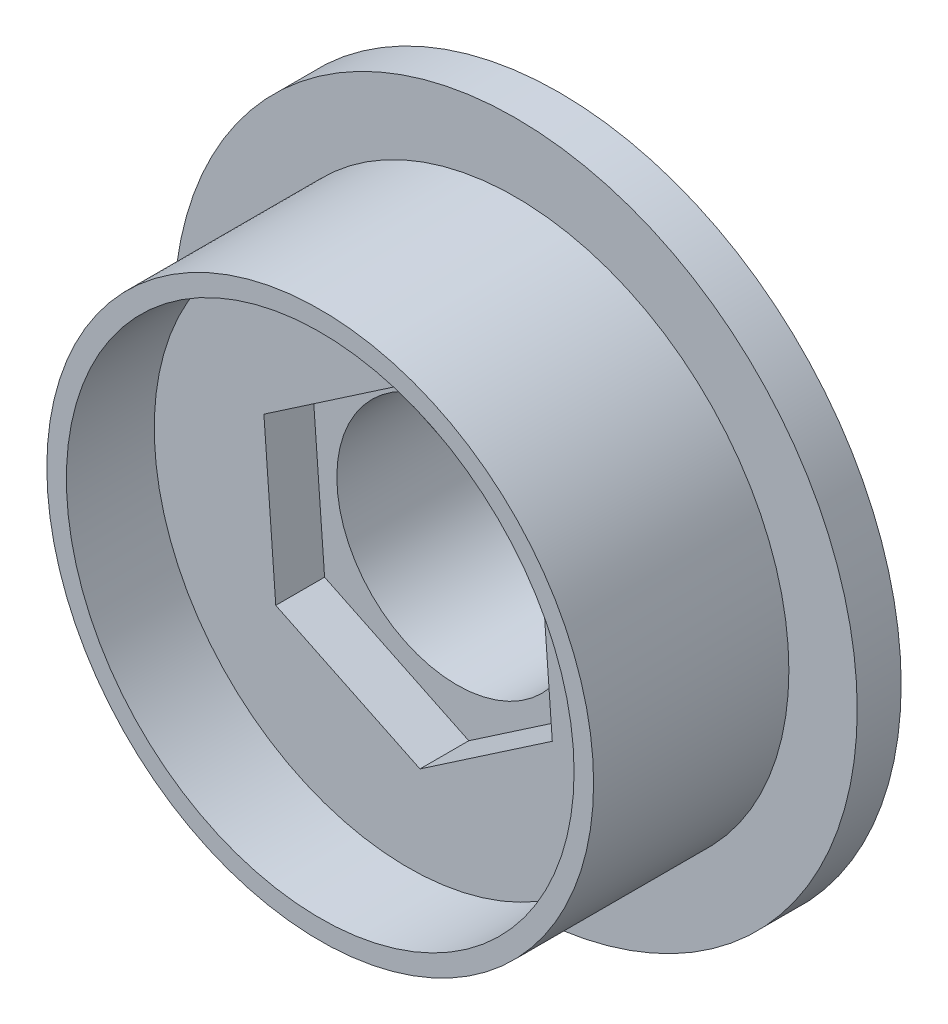
ISO-10303-21;
HEADER;
FILE_DESCRIPTION(('STEP AP214'),'2;1');
FILE_NAME('part.step','',(''),(''),'','','');
FILE_SCHEMA(('AUTOMOTIVE_DESIGN { 1 0 10303 214 1 1 1 1 }'));
ENDSEC;
DATA;
#1=APPLICATION_CONTEXT('core data for automotive mechanical design processes');
#2=APPLICATION_PROTOCOL_DEFINITION('international standard','automotive_design',2000,#1);
#3=PRODUCT_CONTEXT('',#1,'mechanical');
#4=PRODUCT('Part','Part','',(#3));
#5=PRODUCT_RELATED_PRODUCT_CATEGORY('part','',(#4));
#6=PRODUCT_DEFINITION_FORMATION('','',#4);
#7=PRODUCT_DEFINITION_CONTEXT('part definition',#1,'design');
#8=PRODUCT_DEFINITION('design','',#6,#7);
#9=PRODUCT_DEFINITION_SHAPE('','',#8);
#10=(LENGTH_UNIT() NAMED_UNIT(*) SI_UNIT(.MILLI.,.METRE.));
#11=(NAMED_UNIT(*) PLANE_ANGLE_UNIT() SI_UNIT($,.RADIAN.));
#12=(NAMED_UNIT(*) SI_UNIT($,.STERADIAN.) SOLID_ANGLE_UNIT());
#13=UNCERTAINTY_MEASURE_WITH_UNIT(LENGTH_MEASURE(1.E-05),#10,'distance_accuracy_value','');
#14=(GEOMETRIC_REPRESENTATION_CONTEXT(3) GLOBAL_UNCERTAINTY_ASSIGNED_CONTEXT((#13)) GLOBAL_UNIT_ASSIGNED_CONTEXT((#10,
#11,#12)) REPRESENTATION_CONTEXT('',''));
#15=CARTESIAN_POINT('',(0.,0.,0.));
#16=DIRECTION('',(0.,0.,1.));
#17=DIRECTION('',(1.,0.,0.));
#18=AXIS2_PLACEMENT_3D('',#15,#16,#17);
#19=CARTESIAN_POINT('',(-6.77616730245649,-4.75600427750777,-22.0341870366983));
#20=DIRECTION('',(-0.434342885523803,-0.900747610485233,0.));
#21=DIRECTION('',(0.900747610485233,-0.434342885523803,0.));
#22=AXIS2_PLACEMENT_3D('',#19,#20,#21);
#23=PLANE('',#22);
#24=DIRECTION('',(-0.900747610485233,0.434342885523803,0.));
#25=VECTOR('',#24,1.);
#26=CARTESIAN_POINT('',(-6.77616730245648,-4.75600427750777,9.75));
#27=LINE('',#26,#25);
#28=CARTESIAN_POINT('',(0.60849832801848,-8.31690962017206,9.75));
#29=VERTEX_POINT('',#28);
#30=CARTESIAN_POINT('',(-6.77616730245649,-4.75600427750777,9.75));
#31=VERTEX_POINT('',#30);
#32=EDGE_CURVE('E99',#29,#31,#27,.T.);
#33=ORIENTED_EDGE('',*,*,#32,.F.);
#34=DIRECTION('',(0.,0.,1.));
#35=VECTOR('',#34,1.);
#36=CARTESIAN_POINT('',(0.60849832801848,-8.31690962017206,-22.0341870366983));
#37=LINE('',#36,#35);
#38=CARTESIAN_POINT('',(0.60849832801848,-8.31690962017206,7.25));
#39=VERTEX_POINT('',#38);
#40=EDGE_CURVE('E102',#39,#29,#37,.T.);
#41=ORIENTED_EDGE('',*,*,#40,.F.);
#42=DIRECTION('',(-0.900747610485233,0.434342885523803,0.));
#43=VECTOR('',#42,1.);
#44=CARTESIAN_POINT('',(-6.77616730245649,-4.75600427750777,7.25));
#45=LINE('',#44,#43);
#46=CARTESIAN_POINT('',(-6.77616730245649,-4.75600427750777,7.25));
#47=VERTEX_POINT('',#46);
#48=EDGE_CURVE('E71',#39,#47,#45,.T.);
#49=ORIENTED_EDGE('',*,*,#48,.T.);
#50=DIRECTION('',(0.,0.,1.));
#51=VECTOR('',#50,1.);
#52=CARTESIAN_POINT('',(-6.77616730245649,-4.75600427750777,-22.0341870366983));
#53=LINE('',#52,#51);
#54=EDGE_CURVE('E104',#47,#31,#53,.T.);
#55=ORIENTED_EDGE('',*,*,#54,.T.);
#56=EDGE_LOOP('',(#33,#41,#49,#55));
#57=FACE_BOUND('',#56,.T.);
#58=ADVANCED_FACE('F35',(#57),#23,.F.);
#59=CARTESIAN_POINT('',(-7.38466563047497,3.41975642826952,-22.0341870366983));
#60=DIRECTION('',(-0.997241755840243,-0.0742218324259663,0.));
#61=DIRECTION('',(0.0742218324259663,-0.997241755840243,0.));
#62=AXIS2_PLACEMENT_3D('',#59,#60,#61);
#63=PLANE('',#62);
#64=DIRECTION('',(-0.0742218324259663,0.997241755840243,0.));
#65=VECTOR('',#64,1.);
#66=CARTESIAN_POINT('',(-7.38466563047497,3.41975642826952,9.75));
#67=LINE('',#66,#65);
#68=CARTESIAN_POINT('',(-7.38466563047497,3.41975642826953,9.75));
#69=VERTEX_POINT('',#68);
#70=EDGE_CURVE('E105',#31,#69,#67,.T.);
#71=ORIENTED_EDGE('',*,*,#70,.F.);
#72=ORIENTED_EDGE('',*,*,#54,.F.);
#73=DIRECTION('',(-0.0742218324259663,0.997241755840243,0.));
#74=VECTOR('',#73,1.);
#75=CARTESIAN_POINT('',(-7.38466563047497,3.41975642826952,7.25));
#76=LINE('',#75,#74);
#77=CARTESIAN_POINT('',(-7.38466563047497,3.41975642826953,7.25));
#78=VERTEX_POINT('',#77);
#79=EDGE_CURVE('E257',#47,#78,#76,.T.);
#80=ORIENTED_EDGE('',*,*,#79,.T.);
#81=DIRECTION('',(0.,0.,1.));
#82=VECTOR('',#81,1.);
#83=CARTESIAN_POINT('',(-7.38466563047497,3.41975642826952,-22.0341870366983));
#84=LINE('',#83,#82);
#85=EDGE_CURVE('E249',#78,#69,#84,.T.);
#86=ORIENTED_EDGE('',*,*,#85,.T.);
#87=EDGE_LOOP('',(#71,#72,#80,#86));
#88=FACE_BOUND('',#87,.T.);
#89=ADVANCED_FACE('F152',(#88),#63,.F.);
#90=CARTESIAN_POINT('',(-0.608498328018479,8.03461179138254,-22.0341870366983));
#91=DIRECTION('',(-0.562898870316441,0.826525778059266,0.));
#92=DIRECTION('',(-0.826525778059266,-0.562898870316441,0.));
#93=AXIS2_PLACEMENT_3D('',#90,#91,#92);
#94=PLANE('',#93);
#95=DIRECTION('',(0.826525778059266,0.562898870316441,0.));
#96=VECTOR('',#95,1.);
#97=CARTESIAN_POINT('',(-0.608498328018477,8.03461179138254,9.75));
#98=LINE('',#97,#96);
#99=CARTESIAN_POINT('',(-0.608498328018479,8.03461179138254,9.75));
#100=VERTEX_POINT('',#99);
#101=EDGE_CURVE('E264',#69,#100,#98,.T.);
#102=ORIENTED_EDGE('',*,*,#101,.F.);
#103=ORIENTED_EDGE('',*,*,#85,.F.);
#104=DIRECTION('',(0.826525778059266,0.562898870316441,0.));
#105=VECTOR('',#104,1.);
#106=CARTESIAN_POINT('',(-0.608498328018477,8.03461179138254,7.25));
#107=LINE('',#106,#105);
#108=CARTESIAN_POINT('',(-0.608498328018479,8.03461179138254,7.25));
#109=VERTEX_POINT('',#108);
#110=EDGE_CURVE('E259',#78,#109,#107,.T.);
#111=ORIENTED_EDGE('',*,*,#110,.T.);
#112=DIRECTION('',(0.,0.,1.));
#113=VECTOR('',#112,1.);
#114=CARTESIAN_POINT('',(-0.608498328018479,8.03461179138254,-22.0341870366983));
#115=LINE('',#114,#113);
#116=EDGE_CURVE('E248',#109,#100,#115,.T.);
#117=ORIENTED_EDGE('',*,*,#116,.T.);
#118=EDGE_LOOP('',(#102,#103,#111,#117));
#119=FACE_BOUND('',#118,.T.);
#120=ADVANCED_FACE('F157',(#119),#94,.F.);
#121=CARTESIAN_POINT('',(6.77616730245648,4.47370644871825,-22.0341870366983));
#122=DIRECTION('',(0.434342885523804,0.900747610485232,0.));
#123=DIRECTION('',(-0.900747610485232,0.434342885523804,0.));
#124=AXIS2_PLACEMENT_3D('',#121,#122,#123);
#125=PLANE('',#124);
#126=DIRECTION('',(0.900747610485232,-0.434342885523804,0.));
#127=VECTOR('',#126,1.);
#128=CARTESIAN_POINT('',(6.77616730245649,4.47370644871825,9.75));
#129=LINE('',#128,#127);
#130=CARTESIAN_POINT('',(6.77616730245648,4.47370644871825,9.75));
#131=VERTEX_POINT('',#130);
#132=EDGE_CURVE('E243',#100,#131,#129,.T.);
#133=ORIENTED_EDGE('',*,*,#132,.F.);
#134=ORIENTED_EDGE('',*,*,#116,.F.);
#135=DIRECTION('',(0.900747610485232,-0.434342885523804,0.));
#136=VECTOR('',#135,1.);
#137=CARTESIAN_POINT('',(6.77616730245649,4.47370644871825,7.25));
#138=LINE('',#137,#136);
#139=CARTESIAN_POINT('',(6.77616730245648,4.47370644871825,7.25));
#140=VERTEX_POINT('',#139);
#141=EDGE_CURVE('E58',#109,#140,#138,.T.);
#142=ORIENTED_EDGE('',*,*,#141,.T.);
#143=DIRECTION('',(0.,0.,1.));
#144=VECTOR('',#143,1.);
#145=CARTESIAN_POINT('',(6.77616730245648,4.47370644871825,-22.0341870366983));
#146=LINE('',#145,#144);
#147=EDGE_CURVE('E110',#140,#131,#146,.T.);
#148=ORIENTED_EDGE('',*,*,#147,.T.);
#149=EDGE_LOOP('',(#133,#134,#142,#148));
#150=FACE_BOUND('',#149,.T.);
#151=ADVANCED_FACE('F236',(#150),#125,.F.);
#152=CARTESIAN_POINT('',(7.38466563047497,-3.70205425705905,-22.0341870366983));
#153=DIRECTION('',(0.997241755840243,0.0742218324259665,0.));
#154=DIRECTION('',(-0.0742218324259665,0.997241755840243,0.));
#155=AXIS2_PLACEMENT_3D('',#152,#153,#154);
#156=PLANE('',#155);
#157=DIRECTION('',(0.0742218324259665,-0.997241755840243,0.));
#158=VECTOR('',#157,1.);
#159=CARTESIAN_POINT('',(7.38466563047497,-3.70205425705905,9.75));
#160=LINE('',#159,#158);
#161=CARTESIAN_POINT('',(7.38466563047497,-3.70205425705905,9.75));
#162=VERTEX_POINT('',#161);
#163=EDGE_CURVE('E49',#131,#162,#160,.T.);
#164=ORIENTED_EDGE('',*,*,#163,.F.);
#165=ORIENTED_EDGE('',*,*,#147,.F.);
#166=DIRECTION('',(0.0742218324259665,-0.997241755840243,0.));
#167=VECTOR('',#166,1.);
#168=CARTESIAN_POINT('',(7.38466563047497,-3.70205425705905,7.25));
#169=LINE('',#168,#167);
#170=CARTESIAN_POINT('',(7.38466563047497,-3.70205425705905,7.25));
#171=VERTEX_POINT('',#170);
#172=EDGE_CURVE('E255',#140,#171,#169,.T.);
#173=ORIENTED_EDGE('',*,*,#172,.T.);
#174=DIRECTION('',(0.,0.,1.));
#175=VECTOR('',#174,1.);
#176=CARTESIAN_POINT('',(7.38466563047497,-3.70205425705905,-22.0341870366983));
#177=LINE('',#176,#175);
#178=EDGE_CURVE('E108',#171,#162,#177,.T.);
#179=ORIENTED_EDGE('',*,*,#178,.T.);
#180=EDGE_LOOP('',(#164,#165,#173,#179));
#181=FACE_BOUND('',#180,.T.);
#182=ADVANCED_FACE('F147',(#181),#156,.F.);
#183=CARTESIAN_POINT('',(0.60849832801848,-8.31690962017206,-22.0341870366983));
#184=DIRECTION('',(0.56289887031644,-0.826525778059266,0.));
#185=DIRECTION('',(0.826525778059266,0.562898870316441,0.));
#186=AXIS2_PLACEMENT_3D('',#183,#184,#185);
#187=PLANE('',#186);
#188=DIRECTION('',(-0.826525778059266,-0.562898870316441,0.));
#189=VECTOR('',#188,1.);
#190=CARTESIAN_POINT('',(0.608498328018483,-8.31690962017205,9.75));
#191=LINE('',#190,#189);
#192=EDGE_CURVE('E12',#162,#29,#191,.T.);
#193=ORIENTED_EDGE('',*,*,#192,.F.);
#194=ORIENTED_EDGE('',*,*,#178,.F.);
#195=DIRECTION('',(-0.826525778059266,-0.562898870316441,0.));
#196=VECTOR('',#195,1.);
#197=CARTESIAN_POINT('',(0.608498328018483,-8.31690962017205,7.25));
#198=LINE('',#197,#196);
#199=EDGE_CURVE('E81',#171,#39,#198,.T.);
#200=ORIENTED_EDGE('',*,*,#199,.T.);
#201=ORIENTED_EDGE('',*,*,#40,.T.);
#202=EDGE_LOOP('',(#193,#194,#200,#201));
#203=FACE_BOUND('',#202,.T.);
#204=ADVANCED_FACE('F107',(#203),#187,.F.);
#205=CARTESIAN_POINT('',(0.,0.,0.));
#206=DIRECTION('',(0.,0.,-1.));
#207=DIRECTION('',(-1.,0.,0.));
#208=AXIS2_PLACEMENT_3D('',#205,#206,#207);
#209=CYLINDRICAL_SURFACE('',#208,6.15);
#210=CARTESIAN_POINT('',(0.,0.,0.));
#211=DIRECTION('',(0.,0.,-1.));
#212=DIRECTION('',(-1.,0.,0.));
#213=AXIS2_PLACEMENT_3D('',#210,#211,#212);
#214=CIRCLE('',#213,6.15);
#215=CARTESIAN_POINT('',(-6.15,0.,0.));
#216=VERTEX_POINT('',#215);
#217=EDGE_CURVE('E125',#216,#216,#214,.T.);
#218=ORIENTED_EDGE('',*,*,#217,.T.);
#219=EDGE_LOOP('',(#218));
#220=FACE_BOUND('',#219,.T.);
#221=CARTESIAN_POINT('',(0.,0.,7.25));
#222=DIRECTION('',(0.,0.,1.));
#223=DIRECTION('',(1.,0.,0.));
#224=AXIS2_PLACEMENT_3D('',#221,#222,#223);
#225=CIRCLE('',#224,6.15);
#226=CARTESIAN_POINT('',(6.15,0.,7.25));
#227=VERTEX_POINT('',#226);
#228=EDGE_CURVE('E115',#227,#227,#225,.F.);
#229=ORIENTED_EDGE('',*,*,#228,.F.);
#230=EDGE_LOOP('',(#229));
#231=FACE_BOUND('',#230,.T.);
#232=ADVANCED_FACE('F137',(#220,#231),#209,.F.);
#233=CARTESIAN_POINT('',(17.5,0.,4.25));
#234=DIRECTION('',(0.,0.,-1.));
#235=DIRECTION('',(-1.,0.,0.));
#236=AXIS2_PLACEMENT_3D('',#233,#234,#235);
#237=PLANE('',#236);
#238=CARTESIAN_POINT('',(0.,0.,4.25));
#239=DIRECTION('',(0.,0.,-1.));
#240=DIRECTION('',(-1.,0.,0.));
#241=AXIS2_PLACEMENT_3D('',#238,#239,#240);
#242=CIRCLE('',#241,17.5);
#243=CARTESIAN_POINT('',(-17.5,0.,4.25));
#244=VERTEX_POINT('',#243);
#245=EDGE_CURVE('E116',#244,#244,#242,.T.);
#246=ORIENTED_EDGE('',*,*,#245,.F.);
#247=EDGE_LOOP('',(#246));
#248=FACE_BOUND('',#247,.T.);
#249=CARTESIAN_POINT('',(0.,0.,4.25));
#250=DIRECTION('',(0.,0.,-1.));
#251=DIRECTION('',(-1.,0.,0.));
#252=AXIS2_PLACEMENT_3D('',#249,#250,#251);
#253=CIRCLE('',#252,14.);
#254=CARTESIAN_POINT('',(-14.,0.,4.25));
#255=VERTEX_POINT('',#254);
#256=EDGE_CURVE('E43',#255,#255,#253,.T.);
#257=ORIENTED_EDGE('',*,*,#256,.T.);
#258=EDGE_LOOP('',(#257));
#259=FACE_BOUND('',#258,.T.);
#260=ADVANCED_FACE('F37',(#248,#259),#237,.F.);
#261=CARTESIAN_POINT('',(0.,0.,0.));
#262=DIRECTION('',(0.,0.,-1.));
#263=DIRECTION('',(-1.,0.,0.));
#264=AXIS2_PLACEMENT_3D('',#261,#262,#263);
#265=CYLINDRICAL_SURFACE('',#264,14.);
#266=ORIENTED_EDGE('',*,*,#256,.F.);
#267=EDGE_LOOP('',(#266));
#268=FACE_BOUND('',#267,.T.);
#269=CARTESIAN_POINT('',(0.,0.,14.25));
#270=DIRECTION('',(0.,0.,-1.));
#271=DIRECTION('',(-1.,0.,0.));
#272=AXIS2_PLACEMENT_3D('',#269,#270,#271);
#273=CIRCLE('',#272,14.);
#274=CARTESIAN_POINT('',(-14.,0.,14.25));
#275=VERTEX_POINT('',#274);
#276=EDGE_CURVE('E128',#275,#275,#273,.T.);
#277=ORIENTED_EDGE('',*,*,#276,.T.);
#278=EDGE_LOOP('',(#277));
#279=FACE_BOUND('',#278,.T.);
#280=ADVANCED_FACE('F145',(#268,#279),#265,.T.);
#281=CARTESIAN_POINT('',(14.,0.,14.25));
#282=DIRECTION('',(0.,0.,-1.));
#283=DIRECTION('',(-1.,0.,0.));
#284=AXIS2_PLACEMENT_3D('',#281,#282,#283);
#285=PLANE('',#284);
#286=CARTESIAN_POINT('',(0.,0.,14.25));
#287=DIRECTION('',(0.,0.,1.));
#288=DIRECTION('',(1.,0.,0.));
#289=AXIS2_PLACEMENT_3D('',#286,#287,#288);
#290=CIRCLE('',#289,13.);
#291=CARTESIAN_POINT('',(13.,0.,14.25));
#292=VERTEX_POINT('',#291);
#293=EDGE_CURVE('E268',#292,#292,#290,.T.);
#294=ORIENTED_EDGE('',*,*,#293,.F.);
#295=EDGE_LOOP('',(#294));
#296=FACE_BOUND('',#295,.T.);
#297=ORIENTED_EDGE('',*,*,#276,.F.);
#298=EDGE_LOOP('',(#297));
#299=FACE_BOUND('',#298,.T.);
#300=ADVANCED_FACE('F171',(#296,#299),#285,.F.);
#301=CARTESIAN_POINT('',(6.15,0.,0.));
#302=DIRECTION('',(0.,0.,1.));
#303=DIRECTION('',(1.,0.,0.));
#304=AXIS2_PLACEMENT_3D('',#301,#302,#303);
#305=PLANE('',#304);
#306=ORIENTED_EDGE('',*,*,#217,.F.);
#307=EDGE_LOOP('',(#306));
#308=FACE_BOUND('',#307,.T.);
#309=CARTESIAN_POINT('',(0.,0.,0.));
#310=DIRECTION('',(0.,0.,-1.));
#311=DIRECTION('',(-1.,0.,0.));
#312=AXIS2_PLACEMENT_3D('',#309,#310,#311);
#313=CIRCLE('',#312,8.);
#314=CARTESIAN_POINT('',(-8.,0.,0.));
#315=VERTEX_POINT('',#314);
#316=EDGE_CURVE('E122',#315,#315,#313,.T.);
#317=ORIENTED_EDGE('',*,*,#316,.T.);
#318=EDGE_LOOP('',(#317));
#319=FACE_BOUND('',#318,.T.);
#320=ADVANCED_FACE('F168',(#308,#319),#305,.F.);
#321=CARTESIAN_POINT('',(0.,0.,23.5625));
#322=DIRECTION('',(0.,0.,-1.));
#323=DIRECTION('',(-1.,0.,0.));
#324=AXIS2_PLACEMENT_3D('',#321,#322,#323);
#325=DEGENERATE_TOROIDAL_SURFACE('',#324,8.,23.5625,.T.);
#326=ORIENTED_EDGE('',*,*,#316,.F.);
#327=EDGE_LOOP('',(#326));
#328=FACE_BOUND('',#327,.T.);
#329=CARTESIAN_POINT('',(0.,0.,2.));
#330=DIRECTION('',(0.,0.,-1.));
#331=DIRECTION('',(-1.,0.,0.));
#332=AXIS2_PLACEMENT_3D('',#329,#330,#331);
#333=CIRCLE('',#332,17.5);
#334=CARTESIAN_POINT('',(-17.5,0.,2.));
#335=VERTEX_POINT('',#334);
#336=EDGE_CURVE('E119',#335,#335,#333,.T.);
#337=ORIENTED_EDGE('',*,*,#336,.T.);
#338=EDGE_LOOP('',(#337));
#339=FACE_BOUND('',#338,.T.);
#340=ADVANCED_FACE('F165',(#328,#339),#325,.T.);
#341=CARTESIAN_POINT('',(0.,0.,0.));
#342=DIRECTION('',(0.,0.,-1.));
#343=DIRECTION('',(-1.,0.,0.));
#344=AXIS2_PLACEMENT_3D('',#341,#342,#343);
#345=CYLINDRICAL_SURFACE('',#344,17.5);
#346=ORIENTED_EDGE('',*,*,#336,.F.);
#347=EDGE_LOOP('',(#346));
#348=FACE_BOUND('',#347,.T.);
#349=ORIENTED_EDGE('',*,*,#245,.T.);
#350=EDGE_LOOP('',(#349));
#351=FACE_BOUND('',#350,.T.);
#352=ADVANCED_FACE('F162',(#348,#351),#345,.T.);
#353=CARTESIAN_POINT('',(6.15,0.,7.25));
#354=DIRECTION('',(0.,0.,1.));
#355=DIRECTION('',(1.,0.,0.));
#356=AXIS2_PLACEMENT_3D('',#353,#354,#355);
#357=PLANE('',#356);
#358=ORIENTED_EDGE('',*,*,#48,.F.);
#359=ORIENTED_EDGE('',*,*,#199,.F.);
#360=ORIENTED_EDGE('',*,*,#172,.F.);
#361=ORIENTED_EDGE('',*,*,#141,.F.);
#362=ORIENTED_EDGE('',*,*,#110,.F.);
#363=ORIENTED_EDGE('',*,*,#79,.F.);
#364=EDGE_LOOP('',(#358,#359,#360,#361,#362,#363));
#365=FACE_BOUND('',#364,.T.);
#366=ORIENTED_EDGE('',*,*,#228,.T.);
#367=EDGE_LOOP('',(#366));
#368=FACE_BOUND('',#367,.T.);
#369=ADVANCED_FACE('F135',(#365,#368),#357,.T.);
#370=CARTESIAN_POINT('',(6.15,0.,9.75));
#371=DIRECTION('',(0.,0.,1.));
#372=DIRECTION('',(1.,0.,0.));
#373=AXIS2_PLACEMENT_3D('',#370,#371,#372);
#374=PLANE('',#373);
#375=CARTESIAN_POINT('',(0.,0.,9.75));
#376=DIRECTION('',(0.,0.,1.));
#377=DIRECTION('',(1.,0.,0.));
#378=AXIS2_PLACEMENT_3D('',#375,#376,#377);
#379=CIRCLE('',#378,13.);
#380=CARTESIAN_POINT('',(13.,0.,9.75));
#381=VERTEX_POINT('',#380);
#382=EDGE_CURVE('E244',#381,#381,#379,.F.);
#383=ORIENTED_EDGE('',*,*,#382,.F.);
#384=EDGE_LOOP('',(#383));
#385=FACE_BOUND('',#384,.T.);
#386=ORIENTED_EDGE('',*,*,#32,.T.);
#387=ORIENTED_EDGE('',*,*,#70,.T.);
#388=ORIENTED_EDGE('',*,*,#101,.T.);
#389=ORIENTED_EDGE('',*,*,#132,.T.);
#390=ORIENTED_EDGE('',*,*,#163,.T.);
#391=ORIENTED_EDGE('',*,*,#192,.T.);
#392=EDGE_LOOP('',(#386,#387,#388,#389,#390,#391));
#393=FACE_BOUND('',#392,.T.);
#394=ADVANCED_FACE('F98',(#385,#393),#374,.T.);
#395=CARTESIAN_POINT('',(0.,0.,-36.7695526217005));
#396=DIRECTION('',(0.,0.,1.));
#397=DIRECTION('',(1.,0.,0.));
#398=AXIS2_PLACEMENT_3D('',#395,#396,#397);
#399=CYLINDRICAL_SURFACE('',#398,13.);
#400=ORIENTED_EDGE('',*,*,#382,.T.);
#401=EDGE_LOOP('',(#400));
#402=FACE_BOUND('',#401,.T.);
#403=ORIENTED_EDGE('',*,*,#293,.T.);
#404=EDGE_LOOP('',(#403));
#405=FACE_BOUND('',#404,.T.);
#406=ADVANCED_FACE('F213',(#402,#405),#399,.F.);
#407=CLOSED_SHELL('',(#58,#89,#120,#151,#182,#204,#232,#260,#280,#300,#320,#340,#352,#369,#394,#406));
#408=MANIFOLD_SOLID_BREP('B2',#407);
#409=ADVANCED_BREP_SHAPE_REPRESENTATION('',(#18,#408),#14);
#410=SHAPE_DEFINITION_REPRESENTATION(#9,#409);
ENDSEC;
END-ISO-10303-21;
